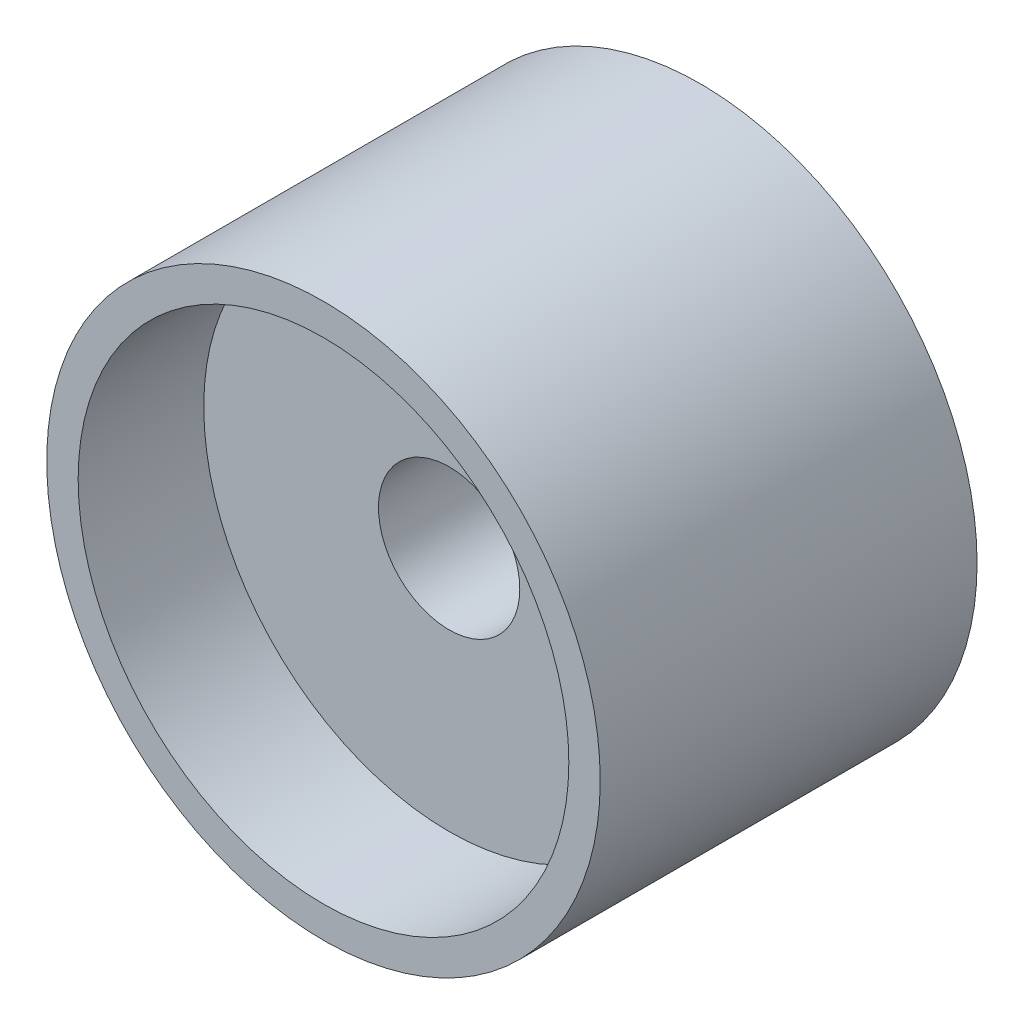
ISO-10303-21;
HEADER;
FILE_DESCRIPTION(('STEP AP214'),'2;1');
FILE_NAME('part.step','',(''),(''),'','','');
FILE_SCHEMA(('AUTOMOTIVE_DESIGN { 1 0 10303 214 1 1 1 1 }'));
ENDSEC;
DATA;
#1=APPLICATION_CONTEXT('core data for automotive mechanical design processes');
#2=APPLICATION_PROTOCOL_DEFINITION('international standard','automotive_design',2000,#1);
#3=PRODUCT_CONTEXT('',#1,'mechanical');
#4=PRODUCT('Part','Part','',(#3));
#5=PRODUCT_RELATED_PRODUCT_CATEGORY('part','',(#4));
#6=PRODUCT_DEFINITION_FORMATION('','',#4);
#7=PRODUCT_DEFINITION_CONTEXT('part definition',#1,'design');
#8=PRODUCT_DEFINITION('design','',#6,#7);
#9=PRODUCT_DEFINITION_SHAPE('','',#8);
#10=(LENGTH_UNIT() NAMED_UNIT(*) SI_UNIT(.MILLI.,.METRE.));
#11=(NAMED_UNIT(*) PLANE_ANGLE_UNIT() SI_UNIT($,.RADIAN.));
#12=(NAMED_UNIT(*) SI_UNIT($,.STERADIAN.) SOLID_ANGLE_UNIT());
#13=UNCERTAINTY_MEASURE_WITH_UNIT(LENGTH_MEASURE(1.E-05),#10,'distance_accuracy_value','');
#14=(GEOMETRIC_REPRESENTATION_CONTEXT(3) GLOBAL_UNCERTAINTY_ASSIGNED_CONTEXT((#13)) GLOBAL_UNIT_ASSIGNED_CONTEXT((#10,
#11,#12)) REPRESENTATION_CONTEXT('',''));
#15=CARTESIAN_POINT('',(0.,0.,0.));
#16=DIRECTION('',(0.,0.,1.));
#17=DIRECTION('',(1.,0.,0.));
#18=AXIS2_PLACEMENT_3D('',#15,#16,#17);
#19=CARTESIAN_POINT('',(0.,0.,3.));
#20=DIRECTION('',(0.,0.,-1.));
#21=DIRECTION('',(-1.,0.,0.));
#22=AXIS2_PLACEMENT_3D('',#19,#20,#21);
#23=CYLINDRICAL_SURFACE('',#22,3.90625);
#24=CARTESIAN_POINT('',(0.,0.,1.));
#25=DIRECTION('',(0.,0.,1.));
#26=DIRECTION('',(1.,0.,0.));
#27=AXIS2_PLACEMENT_3D('',#24,#25,#26);
#28=CIRCLE('',#27,3.90625);
#29=CARTESIAN_POINT('',(3.90625,0.,1.));
#30=VERTEX_POINT('',#29);
#31=EDGE_CURVE('E10',#30,#30,#28,.T.);
#32=ORIENTED_EDGE('',*,*,#31,.F.);
#33=EDGE_LOOP('',(#32));
#34=FACE_BOUND('',#33,.T.);
#35=CARTESIAN_POINT('',(0.,0.,3.));
#36=DIRECTION('',(0.,0.,1.));
#37=DIRECTION('',(1.,0.,0.));
#38=AXIS2_PLACEMENT_3D('',#35,#36,#37);
#39=CIRCLE('',#38,3.90625);
#40=CARTESIAN_POINT('',(3.90625,0.,3.));
#41=VERTEX_POINT('',#40);
#42=EDGE_CURVE('E52',#41,#41,#39,.T.);
#43=ORIENTED_EDGE('',*,*,#42,.T.);
#44=EDGE_LOOP('',(#43));
#45=FACE_BOUND('',#44,.T.);
#46=ADVANCED_FACE('F39',(#34,#45),#23,.F.);
#47=CARTESIAN_POINT('',(0.,0.,3.));
#48=DIRECTION('',(0.,0.,-1.));
#49=DIRECTION('',(-1.,0.,0.));
#50=AXIS2_PLACEMENT_3D('',#47,#48,#49);
#51=CYLINDRICAL_SURFACE('',#50,4.40625);
#52=CARTESIAN_POINT('',(0.,0.,3.));
#53=DIRECTION('',(0.,0.,1.));
#54=DIRECTION('',(1.,0.,0.));
#55=AXIS2_PLACEMENT_3D('',#52,#53,#54);
#56=CIRCLE('',#55,4.40625);
#57=CARTESIAN_POINT('',(4.40625,0.,3.));
#58=VERTEX_POINT('',#57);
#59=EDGE_CURVE('E42',#58,#58,#56,.T.);
#60=ORIENTED_EDGE('',*,*,#59,.F.);
#61=EDGE_LOOP('',(#60));
#62=FACE_BOUND('',#61,.T.);
#63=CARTESIAN_POINT('',(0.,0.,-3.));
#64=DIRECTION('',(0.,0.,1.));
#65=DIRECTION('',(1.,0.,0.));
#66=AXIS2_PLACEMENT_3D('',#63,#64,#65);
#67=CIRCLE('',#66,4.40625);
#68=CARTESIAN_POINT('',(4.40625,0.,-3.));
#69=VERTEX_POINT('',#68);
#70=EDGE_CURVE('E62',#69,#69,#67,.T.);
#71=ORIENTED_EDGE('',*,*,#70,.T.);
#72=EDGE_LOOP('',(#71));
#73=FACE_BOUND('',#72,.T.);
#74=ADVANCED_FACE('F88',(#62,#73),#51,.T.);
#75=CARTESIAN_POINT('',(0.,0.,3.));
#76=DIRECTION('',(0.,0.,1.));
#77=DIRECTION('',(1.,0.,0.));
#78=AXIS2_PLACEMENT_3D('',#75,#76,#77);
#79=PLANE('',#78);
#80=ORIENTED_EDGE('',*,*,#42,.F.);
#81=EDGE_LOOP('',(#80));
#82=FACE_BOUND('',#81,.T.);
#83=ORIENTED_EDGE('',*,*,#59,.T.);
#84=EDGE_LOOP('',(#83));
#85=FACE_BOUND('',#84,.T.);
#86=ADVANCED_FACE('F81',(#82,#85),#79,.T.);
#87=CARTESIAN_POINT('',(0.,0.,1.));
#88=DIRECTION('',(0.,0.,-1.));
#89=DIRECTION('',(-1.,0.,0.));
#90=AXIS2_PLACEMENT_3D('',#87,#88,#89);
#91=CYLINDRICAL_SURFACE('',#90,1.125);
#92=CARTESIAN_POINT('',(0.,0.,1.));
#93=DIRECTION('',(0.,0.,1.));
#94=DIRECTION('',(1.,0.,0.));
#95=AXIS2_PLACEMENT_3D('',#92,#93,#94);
#96=CIRCLE('',#95,1.125);
#97=CARTESIAN_POINT('',(1.125,0.,1.));
#98=VERTEX_POINT('',#97);
#99=EDGE_CURVE('E54',#98,#98,#96,.T.);
#100=ORIENTED_EDGE('',*,*,#99,.T.);
#101=EDGE_LOOP('',(#100));
#102=FACE_BOUND('',#101,.T.);
#103=CARTESIAN_POINT('',(0.,0.,-3.));
#104=DIRECTION('',(0.,0.,1.));
#105=DIRECTION('',(1.,0.,0.));
#106=AXIS2_PLACEMENT_3D('',#103,#104,#105);
#107=CIRCLE('',#106,1.125);
#108=CARTESIAN_POINT('',(1.125,0.,-3.));
#109=VERTEX_POINT('',#108);
#110=EDGE_CURVE('E67',#109,#109,#107,.T.);
#111=ORIENTED_EDGE('',*,*,#110,.F.);
#112=EDGE_LOOP('',(#111));
#113=FACE_BOUND('',#112,.T.);
#114=ADVANCED_FACE('F78',(#102,#113),#91,.F.);
#115=CARTESIAN_POINT('',(0.,0.,1.));
#116=DIRECTION('',(0.,0.,1.));
#117=DIRECTION('',(1.,0.,0.));
#118=AXIS2_PLACEMENT_3D('',#115,#116,#117);
#119=PLANE('',#118);
#120=ORIENTED_EDGE('',*,*,#31,.T.);
#121=EDGE_LOOP('',(#120));
#122=FACE_BOUND('',#121,.T.);
#123=ORIENTED_EDGE('',*,*,#99,.F.);
#124=EDGE_LOOP('',(#123));
#125=FACE_BOUND('',#124,.T.);
#126=ADVANCED_FACE('F80',(#122,#125),#119,.T.);
#127=CARTESIAN_POINT('',(0.,0.,-3.));
#128=DIRECTION('',(0.,0.,1.));
#129=DIRECTION('',(1.,0.,0.));
#130=AXIS2_PLACEMENT_3D('',#127,#128,#129);
#131=PLANE('',#130);
#132=ORIENTED_EDGE('',*,*,#110,.T.);
#133=EDGE_LOOP('',(#132));
#134=FACE_BOUND('',#133,.T.);
#135=ORIENTED_EDGE('',*,*,#70,.F.);
#136=EDGE_LOOP('',(#135));
#137=FACE_BOUND('',#136,.T.);
#138=ADVANCED_FACE('F75',(#134,#137),#131,.F.);
#139=CLOSED_SHELL('',(#46,#74,#86,#114,#126,#138));
#140=MANIFOLD_SOLID_BREP('B2',#139);
#141=ADVANCED_BREP_SHAPE_REPRESENTATION('',(#18,#140),#14);
#142=SHAPE_DEFINITION_REPRESENTATION(#9,#141);
ENDSEC;
END-ISO-10303-21;
